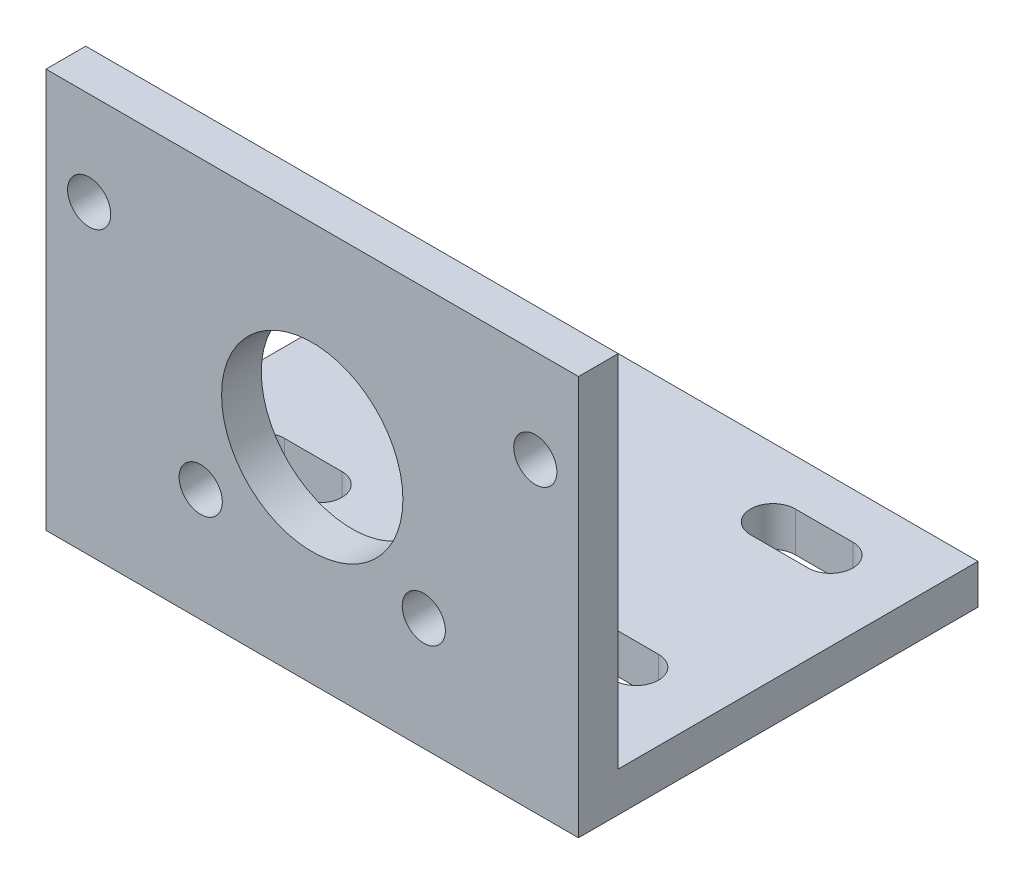
ISO-10303-21;
HEADER;
FILE_DESCRIPTION(('STEP AP214'),'2;1');
FILE_NAME('part.step','',(''),(''),'','','');
FILE_SCHEMA(('AUTOMOTIVE_DESIGN { 1 0 10303 214 1 1 1 1 }'));
ENDSEC;
DATA;
#1=APPLICATION_CONTEXT('core data for automotive mechanical design processes');
#2=APPLICATION_PROTOCOL_DEFINITION('international standard','automotive_design',2000,#1);
#3=PRODUCT_CONTEXT('',#1,'mechanical');
#4=PRODUCT('Part','Part','',(#3));
#5=PRODUCT_RELATED_PRODUCT_CATEGORY('part','',(#4));
#6=PRODUCT_DEFINITION_FORMATION('','',#4);
#7=PRODUCT_DEFINITION_CONTEXT('part definition',#1,'design');
#8=PRODUCT_DEFINITION('design','',#6,#7);
#9=PRODUCT_DEFINITION_SHAPE('','',#8);
#10=(LENGTH_UNIT() NAMED_UNIT(*) SI_UNIT(.MILLI.,.METRE.));
#11=(NAMED_UNIT(*) PLANE_ANGLE_UNIT() SI_UNIT($,.RADIAN.));
#12=(NAMED_UNIT(*) SI_UNIT($,.STERADIAN.) SOLID_ANGLE_UNIT());
#13=UNCERTAINTY_MEASURE_WITH_UNIT(LENGTH_MEASURE(1.E-05),#10,'distance_accuracy_value','');
#14=(GEOMETRIC_REPRESENTATION_CONTEXT(3) GLOBAL_UNCERTAINTY_ASSIGNED_CONTEXT((#13)) GLOBAL_UNIT_ASSIGNED_CONTEXT((#10,
#11,#12)) REPRESENTATION_CONTEXT('',''));
#15=CARTESIAN_POINT('',(0.,0.,0.));
#16=DIRECTION('',(0.,0.,1.));
#17=DIRECTION('',(1.,0.,0.));
#18=AXIS2_PLACEMENT_3D('',#15,#16,#17);
#19=CARTESIAN_POINT('',(18.5,0.,0.));
#20=DIRECTION('',(0.,1.,0.));
#21=DIRECTION('',(0.,0.,1.));
#22=AXIS2_PLACEMENT_3D('',#19,#20,#21);
#23=PLANE('',#22);
#24=DIRECTION('',(-1.,0.,0.));
#25=VECTOR('',#24,1.);
#26=CARTESIAN_POINT('',(9.,0.,-24.565));
#27=LINE('',#26,#25);
#28=CARTESIAN_POINT('',(13.,0.,-24.565));
#29=VERTEX_POINT('',#28);
#30=CARTESIAN_POINT('',(9.,0.,-24.565));
#31=VERTEX_POINT('',#30);
#32=EDGE_CURVE('E265',#29,#31,#27,.T.);
#33=ORIENTED_EDGE('',*,*,#32,.T.);
#34=CARTESIAN_POINT('',(9.,0.,-23.01));
#35=DIRECTION('',(0.,1.,0.));
#36=DIRECTION('',(0.,0.,1.));
#37=AXIS2_PLACEMENT_3D('',#34,#35,#36);
#38=CIRCLE('',#37,1.555);
#39=CARTESIAN_POINT('',(9.,0.,-21.455));
#40=VERTEX_POINT('',#39);
#41=EDGE_CURVE('E257',#31,#40,#38,.T.);
#42=ORIENTED_EDGE('',*,*,#41,.T.);
#43=DIRECTION('',(1.,0.,0.));
#44=VECTOR('',#43,1.);
#45=CARTESIAN_POINT('',(9.,0.,-21.455));
#46=LINE('',#45,#44);
#47=CARTESIAN_POINT('',(13.,0.,-21.455));
#48=VERTEX_POINT('',#47);
#49=EDGE_CURVE('E260',#40,#48,#46,.T.);
#50=ORIENTED_EDGE('',*,*,#49,.T.);
#51=CARTESIAN_POINT('',(13.,0.,-23.01));
#52=DIRECTION('',(0.,1.,0.));
#53=DIRECTION('',(0.,0.,1.));
#54=AXIS2_PLACEMENT_3D('',#51,#52,#53);
#55=CIRCLE('',#54,1.555);
#56=EDGE_CURVE('E49',#48,#29,#55,.T.);
#57=ORIENTED_EDGE('',*,*,#56,.T.);
#58=EDGE_LOOP('',(#33,#42,#50,#57));
#59=FACE_BOUND('',#58,.T.);
#60=DIRECTION('',(-1.,0.,0.));
#61=VECTOR('',#60,1.);
#62=CARTESIAN_POINT('',(9.,0.,-11.065));
#63=LINE('',#62,#61);
#64=CARTESIAN_POINT('',(13.,0.,-11.065));
#65=VERTEX_POINT('',#64);
#66=CARTESIAN_POINT('',(9.,0.,-11.065));
#67=VERTEX_POINT('',#66);
#68=EDGE_CURVE('E235',#65,#67,#63,.T.);
#69=ORIENTED_EDGE('',*,*,#68,.T.);
#70=CARTESIAN_POINT('',(9.,0.,-9.51));
#71=DIRECTION('',(0.,1.,0.));
#72=DIRECTION('',(0.,0.,1.));
#73=AXIS2_PLACEMENT_3D('',#70,#71,#72);
#74=CIRCLE('',#73,1.555);
#75=CARTESIAN_POINT('',(9.,0.,-7.955));
#76=VERTEX_POINT('',#75);
#77=EDGE_CURVE('E227',#67,#76,#74,.T.);
#78=ORIENTED_EDGE('',*,*,#77,.T.);
#79=DIRECTION('',(1.,0.,0.));
#80=VECTOR('',#79,1.);
#81=CARTESIAN_POINT('',(9.,0.,-7.955));
#82=LINE('',#81,#80);
#83=CARTESIAN_POINT('',(13.,0.,-7.955));
#84=VERTEX_POINT('',#83);
#85=EDGE_CURVE('E230',#76,#84,#82,.T.);
#86=ORIENTED_EDGE('',*,*,#85,.T.);
#87=CARTESIAN_POINT('',(13.,0.,-9.51));
#88=DIRECTION('',(0.,1.,0.));
#89=DIRECTION('',(0.,0.,1.));
#90=AXIS2_PLACEMENT_3D('',#87,#88,#89);
#91=CIRCLE('',#90,1.555);
#92=EDGE_CURVE('E57',#84,#65,#91,.T.);
#93=ORIENTED_EDGE('',*,*,#92,.T.);
#94=EDGE_LOOP('',(#69,#78,#86,#93));
#95=FACE_BOUND('',#94,.T.);
#96=DIRECTION('',(-1.,0.,0.));
#97=VECTOR('',#96,1.);
#98=CARTESIAN_POINT('',(-13.,0.,-11.065));
#99=LINE('',#98,#97);
#100=CARTESIAN_POINT('',(-9.,0.,-11.065));
#101=VERTEX_POINT('',#100);
#102=CARTESIAN_POINT('',(-13.,0.,-11.065));
#103=VERTEX_POINT('',#102);
#104=EDGE_CURVE('E195',#101,#103,#99,.T.);
#105=ORIENTED_EDGE('',*,*,#104,.T.);
#106=CARTESIAN_POINT('',(-13.,0.,-9.51));
#107=DIRECTION('',(0.,1.,0.));
#108=DIRECTION('',(0.,0.,1.));
#109=AXIS2_PLACEMENT_3D('',#106,#107,#108);
#110=CIRCLE('',#109,1.555);
#111=CARTESIAN_POINT('',(-13.,0.,-7.955));
#112=VERTEX_POINT('',#111);
#113=EDGE_CURVE('E187',#103,#112,#110,.T.);
#114=ORIENTED_EDGE('',*,*,#113,.T.);
#115=DIRECTION('',(1.,0.,0.));
#116=VECTOR('',#115,1.);
#117=CARTESIAN_POINT('',(-13.,0.,-7.955));
#118=LINE('',#117,#116);
#119=CARTESIAN_POINT('',(-9.,0.,-7.955));
#120=VERTEX_POINT('',#119);
#121=EDGE_CURVE('E199',#112,#120,#118,.T.);
#122=ORIENTED_EDGE('',*,*,#121,.T.);
#123=CARTESIAN_POINT('',(-9.,0.,-9.51));
#124=DIRECTION('',(0.,1.,0.));
#125=DIRECTION('',(0.,0.,1.));
#126=AXIS2_PLACEMENT_3D('',#123,#124,#125);
#127=CIRCLE('',#126,1.555);
#128=EDGE_CURVE('E203',#120,#101,#127,.T.);
#129=ORIENTED_EDGE('',*,*,#128,.T.);
#130=EDGE_LOOP('',(#105,#114,#122,#129));
#131=FACE_BOUND('',#130,.T.);
#132=DIRECTION('',(-1.,0.,0.));
#133=VECTOR('',#132,1.);
#134=CARTESIAN_POINT('',(-13.,0.,-24.565));
#135=LINE('',#134,#133);
#136=CARTESIAN_POINT('',(-9.,0.,-24.565));
#137=VERTEX_POINT('',#136);
#138=CARTESIAN_POINT('',(-13.,0.,-24.565));
#139=VERTEX_POINT('',#138);
#140=EDGE_CURVE('E296',#137,#139,#135,.T.);
#141=ORIENTED_EDGE('',*,*,#140,.T.);
#142=CARTESIAN_POINT('',(-13.,0.,-23.01));
#143=DIRECTION('',(0.,1.,0.));
#144=DIRECTION('',(0.,0.,1.));
#145=AXIS2_PLACEMENT_3D('',#142,#143,#144);
#146=CIRCLE('',#145,1.555);
#147=CARTESIAN_POINT('',(-13.,0.,-21.455));
#148=VERTEX_POINT('',#147);
#149=EDGE_CURVE('E286',#139,#148,#146,.T.);
#150=ORIENTED_EDGE('',*,*,#149,.T.);
#151=DIRECTION('',(1.,0.,0.));
#152=VECTOR('',#151,1.);
#153=CARTESIAN_POINT('',(-13.,0.,-21.455));
#154=LINE('',#153,#152);
#155=CARTESIAN_POINT('',(-9.00000000000001,0.,-21.455));
#156=VERTEX_POINT('',#155);
#157=EDGE_CURVE('E289',#148,#156,#154,.T.);
#158=ORIENTED_EDGE('',*,*,#157,.T.);
#159=CARTESIAN_POINT('',(-9.,0.,-23.01));
#160=DIRECTION('',(0.,1.,0.));
#161=DIRECTION('',(0.,0.,1.));
#162=AXIS2_PLACEMENT_3D('',#159,#160,#161);
#163=CIRCLE('',#162,1.555);
#164=EDGE_CURVE('E293',#156,#137,#163,.T.);
#165=ORIENTED_EDGE('',*,*,#164,.T.);
#166=EDGE_LOOP('',(#141,#150,#158,#165));
#167=FACE_BOUND('',#166,.T.);
#168=DIRECTION('',(0.,0.,-1.));
#169=VECTOR('',#168,1.);
#170=CARTESIAN_POINT('',(-18.5,0.,0.));
#171=LINE('',#170,#169);
#172=CARTESIAN_POINT('',(-18.5,0.,0.));
#173=VERTEX_POINT('',#172);
#174=CARTESIAN_POINT('',(-18.5,0.,-27.76));
#175=VERTEX_POINT('',#174);
#176=EDGE_CURVE('E337',#173,#175,#171,.T.);
#177=ORIENTED_EDGE('',*,*,#176,.T.);
#178=DIRECTION('',(-1.,0.,0.));
#179=VECTOR('',#178,1.);
#180=CARTESIAN_POINT('',(18.5,0.,-27.76));
#181=LINE('',#180,#179);
#182=CARTESIAN_POINT('',(18.5,0.,-27.76));
#183=VERTEX_POINT('',#182);
#184=EDGE_CURVE('E11',#183,#175,#181,.T.);
#185=ORIENTED_EDGE('',*,*,#184,.F.);
#186=DIRECTION('',(0.,0.,-1.));
#187=VECTOR('',#186,1.);
#188=CARTESIAN_POINT('',(18.5,0.,0.));
#189=LINE('',#188,#187);
#190=CARTESIAN_POINT('',(18.5,0.,0.));
#191=VERTEX_POINT('',#190);
#192=EDGE_CURVE('E341',#191,#183,#189,.T.);
#193=ORIENTED_EDGE('',*,*,#192,.F.);
#194=DIRECTION('',(-1.,0.,0.));
#195=VECTOR('',#194,1.);
#196=CARTESIAN_POINT('',(18.5,0.,0.));
#197=LINE('',#196,#195);
#198=EDGE_CURVE('E355',#191,#173,#197,.T.);
#199=ORIENTED_EDGE('',*,*,#198,.T.);
#200=EDGE_LOOP('',(#177,#185,#193,#199));
#201=FACE_BOUND('',#200,.T.);
#202=ADVANCED_FACE('F33',(#59,#95,#131,#167,#201),#23,.F.);
#203=CARTESIAN_POINT('',(18.5,0.,-27.76));
#204=DIRECTION('',(0.,0.,1.));
#205=DIRECTION('',(1.,0.,0.));
#206=AXIS2_PLACEMENT_3D('',#203,#204,#205);
#207=PLANE('',#206);
#208=DIRECTION('',(0.,1.,0.));
#209=VECTOR('',#208,1.);
#210=CARTESIAN_POINT('',(-18.5,0.,-27.76));
#211=LINE('',#210,#209);
#212=CARTESIAN_POINT('',(-18.5,2.76,-27.76));
#213=VERTEX_POINT('',#212);
#214=EDGE_CURVE('E358',#175,#213,#211,.T.);
#215=ORIENTED_EDGE('',*,*,#214,.T.);
#216=DIRECTION('',(-1.,0.,0.));
#217=VECTOR('',#216,1.);
#218=CARTESIAN_POINT('',(18.5,2.76,-27.76));
#219=LINE('',#218,#217);
#220=CARTESIAN_POINT('',(18.5,2.76,-27.76));
#221=VERTEX_POINT('',#220);
#222=EDGE_CURVE('E41',#221,#213,#219,.T.);
#223=ORIENTED_EDGE('',*,*,#222,.F.);
#224=DIRECTION('',(0.,1.,0.));
#225=VECTOR('',#224,1.);
#226=CARTESIAN_POINT('',(18.5,0.,-27.76));
#227=LINE('',#226,#225);
#228=EDGE_CURVE('E344',#183,#221,#227,.T.);
#229=ORIENTED_EDGE('',*,*,#228,.F.);
#230=ORIENTED_EDGE('',*,*,#184,.T.);
#231=EDGE_LOOP('',(#215,#223,#229,#230));
#232=FACE_BOUND('',#231,.T.);
#233=ADVANCED_FACE('F404',(#232),#207,.F.);
#234=CARTESIAN_POINT('',(18.5,2.76,-2.76));
#235=DIRECTION('',(0.,-1.,0.));
#236=DIRECTION('',(0.,0.,-1.));
#237=AXIS2_PLACEMENT_3D('',#234,#235,#236);
#238=PLANE('',#237);
#239=DIRECTION('',(1.,0.,0.));
#240=VECTOR('',#239,1.);
#241=CARTESIAN_POINT('',(9.,2.76,-21.455));
#242=LINE('',#241,#240);
#243=CARTESIAN_POINT('',(9.,2.76,-21.455));
#244=VERTEX_POINT('',#243);
#245=CARTESIAN_POINT('',(13.,2.76,-21.455));
#246=VERTEX_POINT('',#245);
#247=EDGE_CURVE('E271',#244,#246,#242,.T.);
#248=ORIENTED_EDGE('',*,*,#247,.F.);
#249=CARTESIAN_POINT('',(9.,2.76,-23.01));
#250=DIRECTION('',(0.,1.,0.));
#251=DIRECTION('',(0.,0.,1.));
#252=AXIS2_PLACEMENT_3D('',#249,#250,#251);
#253=CIRCLE('',#252,1.555);
#254=CARTESIAN_POINT('',(9.,2.76,-24.565));
#255=VERTEX_POINT('',#254);
#256=EDGE_CURVE('E269',#255,#244,#253,.T.);
#257=ORIENTED_EDGE('',*,*,#256,.F.);
#258=DIRECTION('',(-1.,0.,0.));
#259=VECTOR('',#258,1.);
#260=CARTESIAN_POINT('',(9.,2.76,-24.565));
#261=LINE('',#260,#259);
#262=CARTESIAN_POINT('',(13.,2.76,-24.565));
#263=VERTEX_POINT('',#262);
#264=EDGE_CURVE('E261',#263,#255,#261,.T.);
#265=ORIENTED_EDGE('',*,*,#264,.F.);
#266=CARTESIAN_POINT('',(13.,2.76,-23.01));
#267=DIRECTION('',(0.,1.,0.));
#268=DIRECTION('',(0.,0.,1.));
#269=AXIS2_PLACEMENT_3D('',#266,#267,#268);
#270=CIRCLE('',#269,1.555);
#271=EDGE_CURVE('E274',#246,#263,#270,.T.);
#272=ORIENTED_EDGE('',*,*,#271,.F.);
#273=EDGE_LOOP('',(#248,#257,#265,#272));
#274=FACE_BOUND('',#273,.T.);
#275=DIRECTION('',(1.,0.,0.));
#276=VECTOR('',#275,1.);
#277=CARTESIAN_POINT('',(9.,2.76,-7.955));
#278=LINE('',#277,#276);
#279=CARTESIAN_POINT('',(9.,2.76,-7.955));
#280=VERTEX_POINT('',#279);
#281=CARTESIAN_POINT('',(13.,2.76,-7.955));
#282=VERTEX_POINT('',#281);
#283=EDGE_CURVE('E241',#280,#282,#278,.T.);
#284=ORIENTED_EDGE('',*,*,#283,.F.);
#285=CARTESIAN_POINT('',(9.,2.76,-9.51));
#286=DIRECTION('',(0.,1.,0.));
#287=DIRECTION('',(0.,0.,1.));
#288=AXIS2_PLACEMENT_3D('',#285,#286,#287);
#289=CIRCLE('',#288,1.555);
#290=CARTESIAN_POINT('',(9.,2.76,-11.065));
#291=VERTEX_POINT('',#290);
#292=EDGE_CURVE('E239',#291,#280,#289,.T.);
#293=ORIENTED_EDGE('',*,*,#292,.F.);
#294=DIRECTION('',(-1.,0.,0.));
#295=VECTOR('',#294,1.);
#296=CARTESIAN_POINT('',(9.,2.76,-11.065));
#297=LINE('',#296,#295);
#298=CARTESIAN_POINT('',(13.,2.76,-11.065));
#299=VERTEX_POINT('',#298);
#300=EDGE_CURVE('E231',#299,#291,#297,.T.);
#301=ORIENTED_EDGE('',*,*,#300,.F.);
#302=CARTESIAN_POINT('',(13.,2.76,-9.51));
#303=DIRECTION('',(0.,1.,0.));
#304=DIRECTION('',(0.,0.,1.));
#305=AXIS2_PLACEMENT_3D('',#302,#303,#304);
#306=CIRCLE('',#305,1.555);
#307=EDGE_CURVE('E245',#282,#299,#306,.T.);
#308=ORIENTED_EDGE('',*,*,#307,.F.);
#309=EDGE_LOOP('',(#284,#293,#301,#308));
#310=FACE_BOUND('',#309,.T.);
#311=DIRECTION('',(1.,0.,0.));
#312=VECTOR('',#311,1.);
#313=CARTESIAN_POINT('',(-13.,2.76,-7.955));
#314=LINE('',#313,#312);
#315=CARTESIAN_POINT('',(-13.,2.76,-7.955));
#316=VERTEX_POINT('',#315);
#317=CARTESIAN_POINT('',(-9.,2.76,-7.955));
#318=VERTEX_POINT('',#317);
#319=EDGE_CURVE('E216',#316,#318,#314,.T.);
#320=ORIENTED_EDGE('',*,*,#319,.F.);
#321=CARTESIAN_POINT('',(-13.,2.76,-9.51));
#322=DIRECTION('',(0.,1.,0.));
#323=DIRECTION('',(0.,0.,1.));
#324=AXIS2_PLACEMENT_3D('',#321,#322,#323);
#325=CIRCLE('',#324,1.555);
#326=CARTESIAN_POINT('',(-13.,2.76,-11.065));
#327=VERTEX_POINT('',#326);
#328=EDGE_CURVE('E190',#327,#316,#325,.T.);
#329=ORIENTED_EDGE('',*,*,#328,.F.);
#330=DIRECTION('',(-1.,0.,0.));
#331=VECTOR('',#330,1.);
#332=CARTESIAN_POINT('',(-13.,2.76,-11.065));
#333=LINE('',#332,#331);
#334=CARTESIAN_POINT('',(-9.,2.76,-11.065));
#335=VERTEX_POINT('',#334);
#336=EDGE_CURVE('E207',#335,#327,#333,.T.);
#337=ORIENTED_EDGE('',*,*,#336,.F.);
#338=CARTESIAN_POINT('',(-9.,2.76,-9.51));
#339=DIRECTION('',(0.,1.,0.));
#340=DIRECTION('',(0.,0.,1.));
#341=AXIS2_PLACEMENT_3D('',#338,#339,#340);
#342=CIRCLE('',#341,1.555);
#343=EDGE_CURVE('E210',#318,#335,#342,.T.);
#344=ORIENTED_EDGE('',*,*,#343,.F.);
#345=EDGE_LOOP('',(#320,#329,#337,#344));
#346=FACE_BOUND('',#345,.T.);
#347=DIRECTION('',(1.,0.,0.));
#348=VECTOR('',#347,1.);
#349=CARTESIAN_POINT('',(-13.,2.76,-21.455));
#350=LINE('',#349,#348);
#351=CARTESIAN_POINT('',(-13.,2.76,-21.455));
#352=VERTEX_POINT('',#351);
#353=CARTESIAN_POINT('',(-9.,2.76,-21.455));
#354=VERTEX_POINT('',#353);
#355=EDGE_CURVE('E301',#352,#354,#350,.T.);
#356=ORIENTED_EDGE('',*,*,#355,.F.);
#357=CARTESIAN_POINT('',(-13.,2.76,-23.01));
#358=DIRECTION('',(0.,1.,0.));
#359=DIRECTION('',(0.,0.,1.));
#360=AXIS2_PLACEMENT_3D('',#357,#358,#359);
#361=CIRCLE('',#360,1.555);
#362=CARTESIAN_POINT('',(-13.,2.76,-24.565));
#363=VERTEX_POINT('',#362);
#364=EDGE_CURVE('E223',#363,#352,#361,.T.);
#365=ORIENTED_EDGE('',*,*,#364,.F.);
#366=DIRECTION('',(-1.,0.,0.));
#367=VECTOR('',#366,1.);
#368=CARTESIAN_POINT('',(-13.,2.76,-24.565));
#369=LINE('',#368,#367);
#370=CARTESIAN_POINT('',(-9.,2.76,-24.565));
#371=VERTEX_POINT('',#370);
#372=EDGE_CURVE('E290',#371,#363,#369,.T.);
#373=ORIENTED_EDGE('',*,*,#372,.F.);
#374=CARTESIAN_POINT('',(-9.,2.76,-23.01));
#375=DIRECTION('',(0.,1.,0.));
#376=DIRECTION('',(0.,0.,1.));
#377=AXIS2_PLACEMENT_3D('',#374,#375,#376);
#378=CIRCLE('',#377,1.555);
#379=EDGE_CURVE('E304',#354,#371,#378,.T.);
#380=ORIENTED_EDGE('',*,*,#379,.F.);
#381=EDGE_LOOP('',(#356,#365,#373,#380));
#382=FACE_BOUND('',#381,.T.);
#383=DIRECTION('',(0.,0.,1.));
#384=VECTOR('',#383,1.);
#385=CARTESIAN_POINT('',(-18.5,2.76,-2.76));
#386=LINE('',#385,#384);
#387=CARTESIAN_POINT('',(-18.5,2.76,-2.76));
#388=VERTEX_POINT('',#387);
#389=EDGE_CURVE('E360',#213,#388,#386,.T.);
#390=ORIENTED_EDGE('',*,*,#389,.T.);
#391=DIRECTION('',(-1.,0.,0.));
#392=VECTOR('',#391,1.);
#393=CARTESIAN_POINT('',(18.5,2.76,-2.76));
#394=LINE('',#393,#392);
#395=CARTESIAN_POINT('',(18.5,2.76,-2.76));
#396=VERTEX_POINT('',#395);
#397=EDGE_CURVE('E375',#396,#388,#394,.T.);
#398=ORIENTED_EDGE('',*,*,#397,.F.);
#399=DIRECTION('',(0.,0.,1.));
#400=VECTOR('',#399,1.);
#401=CARTESIAN_POINT('',(18.5,2.76,-2.76));
#402=LINE('',#401,#400);
#403=EDGE_CURVE('E347',#221,#396,#402,.T.);
#404=ORIENTED_EDGE('',*,*,#403,.F.);
#405=ORIENTED_EDGE('',*,*,#222,.T.);
#406=EDGE_LOOP('',(#390,#398,#404,#405));
#407=FACE_BOUND('',#406,.T.);
#408=ADVANCED_FACE('F409',(#274,#310,#346,#382,#407),#238,.F.);
#409=CARTESIAN_POINT('',(18.5,2.76,-2.76));
#410=DIRECTION('',(0.,0.,1.));
#411=DIRECTION('',(1.,0.,0.));
#412=AXIS2_PLACEMENT_3D('',#409,#410,#411);
#413=PLANE('',#412);
#414=CARTESIAN_POINT('',(-15.5,21.26,-2.76));
#415=DIRECTION('',(0.,0.,-1.));
#416=DIRECTION('',(-1.,0.,0.));
#417=AXIS2_PLACEMENT_3D('',#414,#415,#416);
#418=CIRCLE('',#417,1.5);
#419=CARTESIAN_POINT('',(-17.,21.26,-2.76));
#420=VERTEX_POINT('',#419);
#421=EDGE_CURVE('E311',#420,#420,#418,.T.);
#422=ORIENTED_EDGE('',*,*,#421,.F.);
#423=EDGE_LOOP('',(#422));
#424=FACE_BOUND('',#423,.T.);
#425=CARTESIAN_POINT('',(-7.74999999999997,7.83660624134119,-2.76));
#426=DIRECTION('',(0.,0.,-1.));
#427=DIRECTION('',(-1.,0.,0.));
#428=AXIS2_PLACEMENT_3D('',#425,#426,#427);
#429=CIRCLE('',#428,1.5);
#430=CARTESIAN_POINT('',(-9.24999999999996,7.83660624134119,-2.76));
#431=VERTEX_POINT('',#430);
#432=EDGE_CURVE('E320',#431,#431,#429,.T.);
#433=ORIENTED_EDGE('',*,*,#432,.F.);
#434=EDGE_LOOP('',(#433));
#435=FACE_BOUND('',#434,.T.);
#436=CARTESIAN_POINT('',(7.75000000000006,7.83660624134123,-2.76));
#437=DIRECTION('',(0.,0.,-1.));
#438=DIRECTION('',(-1.,0.,0.));
#439=AXIS2_PLACEMENT_3D('',#436,#437,#438);
#440=CIRCLE('',#439,1.5);
#441=CARTESIAN_POINT('',(6.25000000000006,7.83660624134123,-2.76));
#442=VERTEX_POINT('',#441);
#443=EDGE_CURVE('E326',#442,#442,#440,.T.);
#444=ORIENTED_EDGE('',*,*,#443,.F.);
#445=EDGE_LOOP('',(#444));
#446=FACE_BOUND('',#445,.T.);
#447=CARTESIAN_POINT('',(15.5,21.2600000000001,-2.76));
#448=DIRECTION('',(0.,0.,-1.));
#449=DIRECTION('',(-1.,0.,0.));
#450=AXIS2_PLACEMENT_3D('',#447,#448,#449);
#451=CIRCLE('',#450,1.5);
#452=CARTESIAN_POINT('',(14.,21.2600000000001,-2.76));
#453=VERTEX_POINT('',#452);
#454=EDGE_CURVE('E330',#453,#453,#451,.T.);
#455=ORIENTED_EDGE('',*,*,#454,.F.);
#456=EDGE_LOOP('',(#455));
#457=FACE_BOUND('',#456,.T.);
#458=CARTESIAN_POINT('',(0.,14.26,-2.76));
#459=DIRECTION('',(0.,0.,-1.));
#460=DIRECTION('',(-1.,0.,0.));
#461=AXIS2_PLACEMENT_3D('',#458,#459,#460);
#462=CIRCLE('',#461,6.3);
#463=CARTESIAN_POINT('',(-6.3,14.26,-2.76));
#464=VERTEX_POINT('',#463);
#465=EDGE_CURVE('E338',#464,#464,#462,.T.);
#466=ORIENTED_EDGE('',*,*,#465,.F.);
#467=EDGE_LOOP('',(#466));
#468=FACE_BOUND('',#467,.T.);
#469=DIRECTION('',(0.,1.,0.));
#470=VECTOR('',#469,1.);
#471=CARTESIAN_POINT('',(-18.5,2.76,-2.76));
#472=LINE('',#471,#470);
#473=CARTESIAN_POINT('',(-18.5,27.76,-2.76));
#474=VERTEX_POINT('',#473);
#475=EDGE_CURVE('E362',#388,#474,#472,.T.);
#476=ORIENTED_EDGE('',*,*,#475,.T.);
#477=DIRECTION('',(-1.,0.,0.));
#478=VECTOR('',#477,1.);
#479=CARTESIAN_POINT('',(18.5,27.76,-2.76));
#480=LINE('',#479,#478);
#481=CARTESIAN_POINT('',(18.5,27.76,-2.76));
#482=VERTEX_POINT('',#481);
#483=EDGE_CURVE('E372',#482,#474,#480,.T.);
#484=ORIENTED_EDGE('',*,*,#483,.F.);
#485=DIRECTION('',(0.,1.,0.));
#486=VECTOR('',#485,1.);
#487=CARTESIAN_POINT('',(18.5,2.76,-2.76));
#488=LINE('',#487,#486);
#489=EDGE_CURVE('E349',#396,#482,#488,.T.);
#490=ORIENTED_EDGE('',*,*,#489,.F.);
#491=ORIENTED_EDGE('',*,*,#397,.T.);
#492=EDGE_LOOP('',(#476,#484,#490,#491));
#493=FACE_BOUND('',#492,.T.);
#494=ADVANCED_FACE('F430',(#424,#435,#446,#457,#468,#493),#413,.F.);
#495=CARTESIAN_POINT('',(18.5,27.76,0.));
#496=DIRECTION('',(0.,-1.,0.));
#497=DIRECTION('',(0.,0.,-1.));
#498=AXIS2_PLACEMENT_3D('',#495,#496,#497);
#499=PLANE('',#498);
#500=DIRECTION('',(0.,0.,1.));
#501=VECTOR('',#500,1.);
#502=CARTESIAN_POINT('',(-18.5,27.76,0.));
#503=LINE('',#502,#501);
#504=CARTESIAN_POINT('',(-18.5,27.76,0.));
#505=VERTEX_POINT('',#504);
#506=EDGE_CURVE('E364',#474,#505,#503,.T.);
#507=ORIENTED_EDGE('',*,*,#506,.T.);
#508=DIRECTION('',(-1.,0.,0.));
#509=VECTOR('',#508,1.);
#510=CARTESIAN_POINT('',(18.5,27.76,0.));
#511=LINE('',#510,#509);
#512=CARTESIAN_POINT('',(18.5,27.76,0.));
#513=VERTEX_POINT('',#512);
#514=EDGE_CURVE('E369',#513,#505,#511,.T.);
#515=ORIENTED_EDGE('',*,*,#514,.F.);
#516=DIRECTION('',(0.,0.,1.));
#517=VECTOR('',#516,1.);
#518=CARTESIAN_POINT('',(18.5,27.76,0.));
#519=LINE('',#518,#517);
#520=EDGE_CURVE('E351',#482,#513,#519,.T.);
#521=ORIENTED_EDGE('',*,*,#520,.F.);
#522=ORIENTED_EDGE('',*,*,#483,.T.);
#523=EDGE_LOOP('',(#507,#515,#521,#522));
#524=FACE_BOUND('',#523,.T.);
#525=ADVANCED_FACE('F454',(#524),#499,.F.);
#526=CARTESIAN_POINT('',(18.5,0.,0.));
#527=DIRECTION('',(0.,0.,-1.));
#528=DIRECTION('',(-1.,0.,0.));
#529=AXIS2_PLACEMENT_3D('',#526,#527,#528);
#530=PLANE('',#529);
#531=CARTESIAN_POINT('',(-15.5,21.26,0.));
#532=DIRECTION('',(0.,0.,-1.));
#533=DIRECTION('',(-1.,0.,0.));
#534=AXIS2_PLACEMENT_3D('',#531,#532,#533);
#535=CIRCLE('',#534,1.5);
#536=CARTESIAN_POINT('',(-17.,21.26,0.));
#537=VERTEX_POINT('',#536);
#538=EDGE_CURVE('E36',#537,#537,#535,.T.);
#539=ORIENTED_EDGE('',*,*,#538,.T.);
#540=EDGE_LOOP('',(#539));
#541=FACE_BOUND('',#540,.T.);
#542=CARTESIAN_POINT('',(-7.74999999999997,7.83660624134119,0.));
#543=DIRECTION('',(0.,0.,-1.));
#544=DIRECTION('',(-1.,0.,0.));
#545=AXIS2_PLACEMENT_3D('',#542,#543,#544);
#546=CIRCLE('',#545,1.5);
#547=CARTESIAN_POINT('',(-9.24999999999996,7.83660624134119,0.));
#548=VERTEX_POINT('',#547);
#549=EDGE_CURVE('E323',#548,#548,#546,.T.);
#550=ORIENTED_EDGE('',*,*,#549,.T.);
#551=EDGE_LOOP('',(#550));
#552=FACE_BOUND('',#551,.T.);
#553=CARTESIAN_POINT('',(7.75000000000006,7.83660624134123,0.));
#554=DIRECTION('',(0.,0.,-1.));
#555=DIRECTION('',(-1.,0.,0.));
#556=AXIS2_PLACEMENT_3D('',#553,#554,#555);
#557=CIRCLE('',#556,1.5);
#558=CARTESIAN_POINT('',(6.25000000000006,7.83660624134123,0.));
#559=VERTEX_POINT('',#558);
#560=EDGE_CURVE('E329',#559,#559,#557,.T.);
#561=ORIENTED_EDGE('',*,*,#560,.T.);
#562=EDGE_LOOP('',(#561));
#563=FACE_BOUND('',#562,.T.);
#564=CARTESIAN_POINT('',(15.5,21.2600000000001,0.));
#565=DIRECTION('',(0.,0.,-1.));
#566=DIRECTION('',(-1.,0.,0.));
#567=AXIS2_PLACEMENT_3D('',#564,#565,#566);
#568=CIRCLE('',#567,1.5);
#569=CARTESIAN_POINT('',(14.,21.2600000000001,0.));
#570=VERTEX_POINT('',#569);
#571=EDGE_CURVE('E333',#570,#570,#568,.T.);
#572=ORIENTED_EDGE('',*,*,#571,.T.);
#573=EDGE_LOOP('',(#572));
#574=FACE_BOUND('',#573,.T.);
#575=CARTESIAN_POINT('',(0.,14.26,0.));
#576=DIRECTION('',(0.,0.,-1.));
#577=DIRECTION('',(-1.,0.,0.));
#578=AXIS2_PLACEMENT_3D('',#575,#576,#577);
#579=CIRCLE('',#578,6.3);
#580=CARTESIAN_POINT('',(-6.3,14.26,0.));
#581=VERTEX_POINT('',#580);
#582=EDGE_CURVE('E334',#581,#581,#579,.T.);
#583=ORIENTED_EDGE('',*,*,#582,.T.);
#584=EDGE_LOOP('',(#583));
#585=FACE_BOUND('',#584,.T.);
#586=DIRECTION('',(0.,-1.,0.));
#587=VECTOR('',#586,1.);
#588=CARTESIAN_POINT('',(-18.5,0.,0.));
#589=LINE('',#588,#587);
#590=EDGE_CURVE('E345',#505,#173,#589,.T.);
#591=ORIENTED_EDGE('',*,*,#590,.T.);
#592=ORIENTED_EDGE('',*,*,#198,.F.);
#593=DIRECTION('',(0.,-1.,0.));
#594=VECTOR('',#593,1.);
#595=CARTESIAN_POINT('',(18.5,0.,0.));
#596=LINE('',#595,#594);
#597=EDGE_CURVE('E353',#513,#191,#596,.T.);
#598=ORIENTED_EDGE('',*,*,#597,.F.);
#599=ORIENTED_EDGE('',*,*,#514,.T.);
#600=EDGE_LOOP('',(#591,#592,#598,#599));
#601=FACE_BOUND('',#600,.T.);
#602=ADVANCED_FACE('F384',(#541,#552,#563,#574,#585,#601),#530,.F.);
#603=CARTESIAN_POINT('',(18.5,0.,0.));
#604=DIRECTION('',(1.,0.,0.));
#605=DIRECTION('',(0.,0.,-1.));
#606=AXIS2_PLACEMENT_3D('',#603,#604,#605);
#607=PLANE('',#606);
#608=ORIENTED_EDGE('',*,*,#192,.T.);
#609=ORIENTED_EDGE('',*,*,#228,.T.);
#610=ORIENTED_EDGE('',*,*,#403,.T.);
#611=ORIENTED_EDGE('',*,*,#489,.T.);
#612=ORIENTED_EDGE('',*,*,#520,.T.);
#613=ORIENTED_EDGE('',*,*,#597,.T.);
#614=EDGE_LOOP('',(#608,#609,#610,#611,#612,#613));
#615=FACE_BOUND('',#614,.T.);
#616=ADVANCED_FACE('F461',(#615),#607,.T.);
#617=CARTESIAN_POINT('',(-18.5,0.,0.));
#618=DIRECTION('',(1.,0.,0.));
#619=DIRECTION('',(0.,0.,-1.));
#620=AXIS2_PLACEMENT_3D('',#617,#618,#619);
#621=PLANE('',#620);
#622=ORIENTED_EDGE('',*,*,#176,.F.);
#623=ORIENTED_EDGE('',*,*,#590,.F.);
#624=ORIENTED_EDGE('',*,*,#506,.F.);
#625=ORIENTED_EDGE('',*,*,#475,.F.);
#626=ORIENTED_EDGE('',*,*,#389,.F.);
#627=ORIENTED_EDGE('',*,*,#214,.F.);
#628=EDGE_LOOP('',(#622,#623,#624,#625,#626,#627));
#629=FACE_BOUND('',#628,.T.);
#630=ADVANCED_FACE('F450',(#629),#621,.F.);
#631=CARTESIAN_POINT('',(0.,14.26,0.));
#632=DIRECTION('',(0.,0.,-1.));
#633=DIRECTION('',(-1.,0.,0.));
#634=AXIS2_PLACEMENT_3D('',#631,#632,#633);
#635=CYLINDRICAL_SURFACE('',#634,6.3);
#636=ORIENTED_EDGE('',*,*,#582,.F.);
#637=EDGE_LOOP('',(#636));
#638=FACE_BOUND('',#637,.T.);
#639=ORIENTED_EDGE('',*,*,#465,.T.);
#640=EDGE_LOOP('',(#639));
#641=FACE_BOUND('',#640,.T.);
#642=ADVANCED_FACE('F400',(#638,#641),#635,.F.);
#643=CARTESIAN_POINT('',(15.5,21.2600000000001,-2.76));
#644=DIRECTION('',(0.,0.,-1.));
#645=DIRECTION('',(-1.,0.,0.));
#646=AXIS2_PLACEMENT_3D('',#643,#644,#645);
#647=CYLINDRICAL_SURFACE('',#646,1.5);
#648=ORIENTED_EDGE('',*,*,#454,.T.);
#649=EDGE_LOOP('',(#648));
#650=FACE_BOUND('',#649,.T.);
#651=ORIENTED_EDGE('',*,*,#571,.F.);
#652=EDGE_LOOP('',(#651));
#653=FACE_BOUND('',#652,.T.);
#654=ADVANCED_FACE('F390',(#650,#653),#647,.F.);
#655=CARTESIAN_POINT('',(7.75000000000006,7.83660624134123,-2.76));
#656=DIRECTION('',(0.,0.,-1.));
#657=DIRECTION('',(-1.,0.,0.));
#658=AXIS2_PLACEMENT_3D('',#655,#656,#657);
#659=CYLINDRICAL_SURFACE('',#658,1.5);
#660=ORIENTED_EDGE('',*,*,#443,.T.);
#661=EDGE_LOOP('',(#660));
#662=FACE_BOUND('',#661,.T.);
#663=ORIENTED_EDGE('',*,*,#560,.F.);
#664=EDGE_LOOP('',(#663));
#665=FACE_BOUND('',#664,.T.);
#666=ADVANCED_FACE('F387',(#662,#665),#659,.F.);
#667=CARTESIAN_POINT('',(-7.74999999999997,7.83660624134119,-2.76));
#668=DIRECTION('',(0.,0.,-1.));
#669=DIRECTION('',(-1.,0.,0.));
#670=AXIS2_PLACEMENT_3D('',#667,#668,#669);
#671=CYLINDRICAL_SURFACE('',#670,1.5);
#672=ORIENTED_EDGE('',*,*,#432,.T.);
#673=EDGE_LOOP('',(#672));
#674=FACE_BOUND('',#673,.T.);
#675=ORIENTED_EDGE('',*,*,#549,.F.);
#676=EDGE_LOOP('',(#675));
#677=FACE_BOUND('',#676,.T.);
#678=ADVANCED_FACE('F389',(#674,#677),#671,.F.);
#679=CARTESIAN_POINT('',(-15.5,21.26,-2.76));
#680=DIRECTION('',(0.,0.,-1.));
#681=DIRECTION('',(-1.,0.,0.));
#682=AXIS2_PLACEMENT_3D('',#679,#680,#681);
#683=CYLINDRICAL_SURFACE('',#682,1.5);
#684=ORIENTED_EDGE('',*,*,#421,.T.);
#685=EDGE_LOOP('',(#684));
#686=FACE_BOUND('',#685,.T.);
#687=ORIENTED_EDGE('',*,*,#538,.F.);
#688=EDGE_LOOP('',(#687));
#689=FACE_BOUND('',#688,.T.);
#690=ADVANCED_FACE('F397',(#686,#689),#683,.F.);
#691=CARTESIAN_POINT('',(-13.,0.,-23.01));
#692=DIRECTION('',(0.,1.,0.));
#693=DIRECTION('',(0.,0.,1.));
#694=AXIS2_PLACEMENT_3D('',#691,#692,#693);
#695=CYLINDRICAL_SURFACE('',#694,1.555);
#696=ORIENTED_EDGE('',*,*,#364,.T.);
#697=DIRECTION('',(0.,1.,0.));
#698=VECTOR('',#697,1.);
#699=CARTESIAN_POINT('',(-13.,0.,-21.455));
#700=LINE('',#699,#698);
#701=EDGE_CURVE('E299',#148,#352,#700,.T.);
#702=ORIENTED_EDGE('',*,*,#701,.F.);
#703=ORIENTED_EDGE('',*,*,#149,.F.);
#704=DIRECTION('',(0.,1.,0.));
#705=VECTOR('',#704,1.);
#706=CARTESIAN_POINT('',(-13.,0.,-24.565));
#707=LINE('',#706,#705);
#708=EDGE_CURVE('E309',#139,#363,#707,.T.);
#709=ORIENTED_EDGE('',*,*,#708,.T.);
#710=EDGE_LOOP('',(#696,#702,#703,#709));
#711=FACE_BOUND('',#710,.T.);
#712=ADVANCED_FACE('F524',(#711),#695,.F.);
#713=CARTESIAN_POINT('',(-13.,0.,-24.565));
#714=DIRECTION('',(0.,0.,-1.));
#715=DIRECTION('',(0.,1.,0.));
#716=AXIS2_PLACEMENT_3D('',#713,#714,#715);
#717=PLANE('',#716);
#718=ORIENTED_EDGE('',*,*,#372,.T.);
#719=ORIENTED_EDGE('',*,*,#708,.F.);
#720=ORIENTED_EDGE('',*,*,#140,.F.);
#721=DIRECTION('',(0.,1.,0.));
#722=VECTOR('',#721,1.);
#723=CARTESIAN_POINT('',(-9.,0.,-24.565));
#724=LINE('',#723,#722);
#725=EDGE_CURVE('E312',#137,#371,#724,.T.);
#726=ORIENTED_EDGE('',*,*,#725,.T.);
#727=EDGE_LOOP('',(#718,#719,#720,#726));
#728=FACE_BOUND('',#727,.T.);
#729=ADVANCED_FACE('F547',(#728),#717,.F.);
#730=CARTESIAN_POINT('',(-9.,0.,-23.01));
#731=DIRECTION('',(0.,1.,0.));
#732=DIRECTION('',(0.,0.,1.));
#733=AXIS2_PLACEMENT_3D('',#730,#731,#732);
#734=CYLINDRICAL_SURFACE('',#733,1.555);
#735=ORIENTED_EDGE('',*,*,#379,.T.);
#736=ORIENTED_EDGE('',*,*,#725,.F.);
#737=ORIENTED_EDGE('',*,*,#164,.F.);
#738=DIRECTION('',(0.,1.,0.));
#739=VECTOR('',#738,1.);
#740=CARTESIAN_POINT('',(-9.,0.,-21.455));
#741=LINE('',#740,#739);
#742=EDGE_CURVE('E314',#156,#354,#741,.T.);
#743=ORIENTED_EDGE('',*,*,#742,.T.);
#744=EDGE_LOOP('',(#735,#736,#737,#743));
#745=FACE_BOUND('',#744,.T.);
#746=ADVANCED_FACE('F557',(#745),#734,.F.);
#747=CARTESIAN_POINT('',(-13.,0.,-21.455));
#748=DIRECTION('',(0.,0.,1.));
#749=DIRECTION('',(0.,-1.,0.));
#750=AXIS2_PLACEMENT_3D('',#747,#748,#749);
#751=PLANE('',#750);
#752=ORIENTED_EDGE('',*,*,#355,.T.);
#753=ORIENTED_EDGE('',*,*,#742,.F.);
#754=ORIENTED_EDGE('',*,*,#157,.F.);
#755=ORIENTED_EDGE('',*,*,#701,.T.);
#756=EDGE_LOOP('',(#752,#753,#754,#755));
#757=FACE_BOUND('',#756,.T.);
#758=ADVANCED_FACE('F567',(#757),#751,.F.);
#759=CARTESIAN_POINT('',(-13.,0.,-9.51));
#760=DIRECTION('',(0.,1.,0.));
#761=DIRECTION('',(0.,0.,1.));
#762=AXIS2_PLACEMENT_3D('',#759,#760,#761);
#763=CYLINDRICAL_SURFACE('',#762,1.555);
#764=ORIENTED_EDGE('',*,*,#328,.T.);
#765=DIRECTION('',(0.,1.,0.));
#766=VECTOR('',#765,1.);
#767=CARTESIAN_POINT('',(-13.,0.,-7.955));
#768=LINE('',#767,#766);
#769=EDGE_CURVE('E183',#112,#316,#768,.T.);
#770=ORIENTED_EDGE('',*,*,#769,.F.);
#771=ORIENTED_EDGE('',*,*,#113,.F.);
#772=DIRECTION('',(0.,1.,0.));
#773=VECTOR('',#772,1.);
#774=CARTESIAN_POINT('',(-13.,0.,-11.065));
#775=LINE('',#774,#773);
#776=EDGE_CURVE('E221',#103,#327,#775,.T.);
#777=ORIENTED_EDGE('',*,*,#776,.T.);
#778=EDGE_LOOP('',(#764,#770,#771,#777));
#779=FACE_BOUND('',#778,.T.);
#780=ADVANCED_FACE('F185',(#779),#763,.F.);
#781=CARTESIAN_POINT('',(-13.,0.,-11.065));
#782=DIRECTION('',(0.,0.,-1.));
#783=DIRECTION('',(0.,1.,0.));
#784=AXIS2_PLACEMENT_3D('',#781,#782,#783);
#785=PLANE('',#784);
#786=ORIENTED_EDGE('',*,*,#336,.T.);
#787=ORIENTED_EDGE('',*,*,#776,.F.);
#788=ORIENTED_EDGE('',*,*,#104,.F.);
#789=DIRECTION('',(0.,1.,0.));
#790=VECTOR('',#789,1.);
#791=CARTESIAN_POINT('',(-9.,0.,-11.065));
#792=LINE('',#791,#790);
#793=EDGE_CURVE('E224',#101,#335,#792,.T.);
#794=ORIENTED_EDGE('',*,*,#793,.T.);
#795=EDGE_LOOP('',(#786,#787,#788,#794));
#796=FACE_BOUND('',#795,.T.);
#797=ADVANCED_FACE('F586',(#796),#785,.F.);
#798=CARTESIAN_POINT('',(-9.,0.,-9.51));
#799=DIRECTION('',(0.,1.,0.));
#800=DIRECTION('',(0.,0.,1.));
#801=AXIS2_PLACEMENT_3D('',#798,#799,#800);
#802=CYLINDRICAL_SURFACE('',#801,1.555);
#803=ORIENTED_EDGE('',*,*,#343,.T.);
#804=ORIENTED_EDGE('',*,*,#793,.F.);
#805=ORIENTED_EDGE('',*,*,#128,.F.);
#806=DIRECTION('',(0.,1.,0.));
#807=VECTOR('',#806,1.);
#808=CARTESIAN_POINT('',(-9.,0.,-7.955));
#809=LINE('',#808,#807);
#810=EDGE_CURVE('E194',#120,#318,#809,.T.);
#811=ORIENTED_EDGE('',*,*,#810,.T.);
#812=EDGE_LOOP('',(#803,#804,#805,#811));
#813=FACE_BOUND('',#812,.T.);
#814=ADVANCED_FACE('F595',(#813),#802,.F.);
#815=CARTESIAN_POINT('',(-13.,0.,-7.955));
#816=DIRECTION('',(0.,0.,1.));
#817=DIRECTION('',(0.,-1.,0.));
#818=AXIS2_PLACEMENT_3D('',#815,#816,#817);
#819=PLANE('',#818);
#820=ORIENTED_EDGE('',*,*,#319,.T.);
#821=ORIENTED_EDGE('',*,*,#810,.F.);
#822=ORIENTED_EDGE('',*,*,#121,.F.);
#823=ORIENTED_EDGE('',*,*,#769,.T.);
#824=EDGE_LOOP('',(#820,#821,#822,#823));
#825=FACE_BOUND('',#824,.T.);
#826=ADVANCED_FACE('F200',(#825),#819,.F.);
#827=CARTESIAN_POINT('',(9.,0.,-9.51));
#828=DIRECTION('',(0.,1.,0.));
#829=DIRECTION('',(0.,0.,1.));
#830=AXIS2_PLACEMENT_3D('',#827,#828,#829);
#831=CYLINDRICAL_SURFACE('',#830,1.555);
#832=ORIENTED_EDGE('',*,*,#292,.T.);
#833=DIRECTION('',(0.,1.,0.));
#834=VECTOR('',#833,1.);
#835=CARTESIAN_POINT('',(9.,0.,-7.955));
#836=LINE('',#835,#834);
#837=EDGE_CURVE('E238',#76,#280,#836,.T.);
#838=ORIENTED_EDGE('',*,*,#837,.F.);
#839=ORIENTED_EDGE('',*,*,#77,.F.);
#840=DIRECTION('',(0.,1.,0.));
#841=VECTOR('',#840,1.);
#842=CARTESIAN_POINT('',(9.,0.,-11.065));
#843=LINE('',#842,#841);
#844=EDGE_CURVE('E217',#67,#291,#843,.T.);
#845=ORIENTED_EDGE('',*,*,#844,.T.);
#846=EDGE_LOOP('',(#832,#838,#839,#845));
#847=FACE_BOUND('',#846,.T.);
#848=ADVANCED_FACE('F420',(#847),#831,.F.);
#849=CARTESIAN_POINT('',(9.,0.,-11.065));
#850=DIRECTION('',(0.,0.,-1.));
#851=DIRECTION('',(0.,1.,0.));
#852=AXIS2_PLACEMENT_3D('',#849,#850,#851);
#853=PLANE('',#852);
#854=ORIENTED_EDGE('',*,*,#300,.T.);
#855=ORIENTED_EDGE('',*,*,#844,.F.);
#856=ORIENTED_EDGE('',*,*,#68,.F.);
#857=DIRECTION('',(0.,1.,0.));
#858=VECTOR('',#857,1.);
#859=CARTESIAN_POINT('',(13.,0.,-11.065));
#860=LINE('',#859,#858);
#861=EDGE_CURVE('E251',#65,#299,#860,.T.);
#862=ORIENTED_EDGE('',*,*,#861,.T.);
#863=EDGE_LOOP('',(#854,#855,#856,#862));
#864=FACE_BOUND('',#863,.T.);
#865=ADVANCED_FACE('F416',(#864),#853,.F.);
#866=CARTESIAN_POINT('',(13.,0.,-9.51));
#867=DIRECTION('',(0.,1.,0.));
#868=DIRECTION('',(0.,0.,1.));
#869=AXIS2_PLACEMENT_3D('',#866,#867,#868);
#870=CYLINDRICAL_SURFACE('',#869,1.555);
#871=ORIENTED_EDGE('',*,*,#307,.T.);
#872=ORIENTED_EDGE('',*,*,#861,.F.);
#873=ORIENTED_EDGE('',*,*,#92,.F.);
#874=DIRECTION('',(0.,1.,0.));
#875=VECTOR('',#874,1.);
#876=CARTESIAN_POINT('',(13.,0.,-7.955));
#877=LINE('',#876,#875);
#878=EDGE_CURVE('E253',#84,#282,#877,.T.);
#879=ORIENTED_EDGE('',*,*,#878,.T.);
#880=EDGE_LOOP('',(#871,#872,#873,#879));
#881=FACE_BOUND('',#880,.T.);
#882=ADVANCED_FACE('F426',(#881),#870,.F.);
#883=CARTESIAN_POINT('',(9.,0.,-7.955));
#884=DIRECTION('',(0.,0.,1.));
#885=DIRECTION('',(0.,-1.,0.));
#886=AXIS2_PLACEMENT_3D('',#883,#884,#885);
#887=PLANE('',#886);
#888=ORIENTED_EDGE('',*,*,#283,.T.);
#889=ORIENTED_EDGE('',*,*,#878,.F.);
#890=ORIENTED_EDGE('',*,*,#85,.F.);
#891=ORIENTED_EDGE('',*,*,#837,.T.);
#892=EDGE_LOOP('',(#888,#889,#890,#891));
#893=FACE_BOUND('',#892,.T.);
#894=ADVANCED_FACE('F424',(#893),#887,.F.);
#895=CARTESIAN_POINT('',(9.,0.,-23.01));
#896=DIRECTION('',(0.,1.,0.));
#897=DIRECTION('',(0.,0.,1.));
#898=AXIS2_PLACEMENT_3D('',#895,#896,#897);
#899=CYLINDRICAL_SURFACE('',#898,1.555);
#900=ORIENTED_EDGE('',*,*,#256,.T.);
#901=DIRECTION('',(0.,1.,0.));
#902=VECTOR('',#901,1.);
#903=CARTESIAN_POINT('',(9.,0.,-21.455));
#904=LINE('',#903,#902);
#905=EDGE_CURVE('E268',#40,#244,#904,.T.);
#906=ORIENTED_EDGE('',*,*,#905,.F.);
#907=ORIENTED_EDGE('',*,*,#41,.F.);
#908=DIRECTION('',(0.,1.,0.));
#909=VECTOR('',#908,1.);
#910=CARTESIAN_POINT('',(9.,0.,-24.565));
#911=LINE('',#910,#909);
#912=EDGE_CURVE('E242',#31,#255,#911,.T.);
#913=ORIENTED_EDGE('',*,*,#912,.T.);
#914=EDGE_LOOP('',(#900,#906,#907,#913));
#915=FACE_BOUND('',#914,.T.);
#916=ADVANCED_FACE('F646',(#915),#899,.F.);
#917=CARTESIAN_POINT('',(9.,0.,-24.565));
#918=DIRECTION('',(0.,0.,-1.));
#919=DIRECTION('',(0.,1.,0.));
#920=AXIS2_PLACEMENT_3D('',#917,#918,#919);
#921=PLANE('',#920);
#922=ORIENTED_EDGE('',*,*,#264,.T.);
#923=ORIENTED_EDGE('',*,*,#912,.F.);
#924=ORIENTED_EDGE('',*,*,#32,.F.);
#925=DIRECTION('',(0.,1.,0.));
#926=VECTOR('',#925,1.);
#927=CARTESIAN_POINT('',(13.,0.,-24.565));
#928=LINE('',#927,#926);
#929=EDGE_CURVE('E280',#29,#263,#928,.T.);
#930=ORIENTED_EDGE('',*,*,#929,.T.);
#931=EDGE_LOOP('',(#922,#923,#924,#930));
#932=FACE_BOUND('',#931,.T.);
#933=ADVANCED_FACE('F655',(#932),#921,.F.);
#934=CARTESIAN_POINT('',(13.,0.,-23.01));
#935=DIRECTION('',(0.,1.,0.));
#936=DIRECTION('',(0.,0.,1.));
#937=AXIS2_PLACEMENT_3D('',#934,#935,#936);
#938=CYLINDRICAL_SURFACE('',#937,1.555);
#939=ORIENTED_EDGE('',*,*,#271,.T.);
#940=ORIENTED_EDGE('',*,*,#929,.F.);
#941=ORIENTED_EDGE('',*,*,#56,.F.);
#942=DIRECTION('',(0.,1.,0.));
#943=VECTOR('',#942,1.);
#944=CARTESIAN_POINT('',(13.,0.,-21.455));
#945=LINE('',#944,#943);
#946=EDGE_CURVE('E282',#48,#246,#945,.T.);
#947=ORIENTED_EDGE('',*,*,#946,.T.);
#948=EDGE_LOOP('',(#939,#940,#941,#947));
#949=FACE_BOUND('',#948,.T.);
#950=ADVANCED_FACE('F665',(#949),#938,.F.);
#951=CARTESIAN_POINT('',(9.,0.,-21.455));
#952=DIRECTION('',(0.,0.,1.));
#953=DIRECTION('',(0.,-1.,0.));
#954=AXIS2_PLACEMENT_3D('',#951,#952,#953);
#955=PLANE('',#954);
#956=ORIENTED_EDGE('',*,*,#247,.T.);
#957=ORIENTED_EDGE('',*,*,#946,.F.);
#958=ORIENTED_EDGE('',*,*,#49,.F.);
#959=ORIENTED_EDGE('',*,*,#905,.T.);
#960=EDGE_LOOP('',(#956,#957,#958,#959));
#961=FACE_BOUND('',#960,.T.);
#962=ADVANCED_FACE('F675',(#961),#955,.F.);
#963=CLOSED_SHELL('',(#202,#233,#408,#494,#525,#602,#616,#630,#642,#654,#666,#678,#690,#712,
#729,#746,#758,#780,#797,#814,#826,#848,#865,#882,#894,#916,#933,#950,#962));
#964=MANIFOLD_SOLID_BREP('B2',#963);
#965=ADVANCED_BREP_SHAPE_REPRESENTATION('',(#18,#964),#14);
#966=SHAPE_DEFINITION_REPRESENTATION(#9,#965);
ENDSEC;
END-ISO-10303-21;
